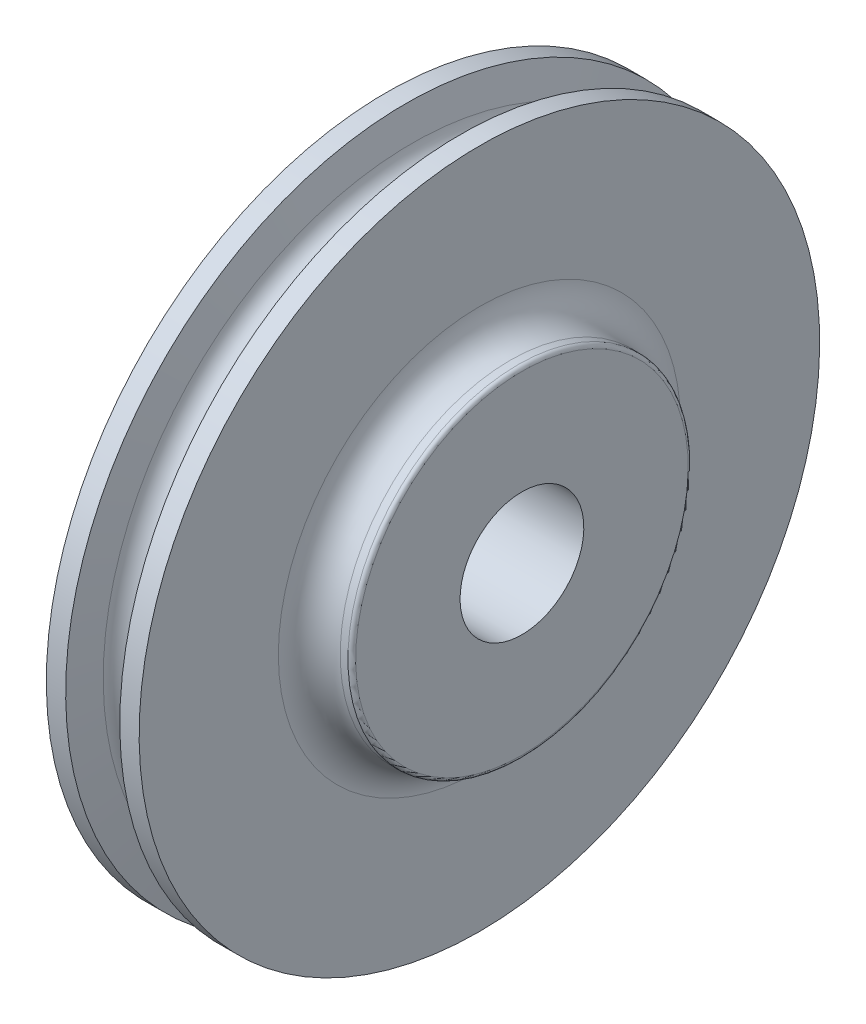
ISO-10303-21;
HEADER;
FILE_DESCRIPTION(('STEP AP214'),'2;1');
FILE_NAME('part.step','',(''),(''),'','','');
FILE_SCHEMA(('AUTOMOTIVE_DESIGN { 1 0 10303 214 1 1 1 1 }'));
ENDSEC;
DATA;
#1=APPLICATION_CONTEXT('core data for automotive mechanical design processes');
#2=APPLICATION_PROTOCOL_DEFINITION('international standard','automotive_design',2000,#1);
#3=PRODUCT_CONTEXT('',#1,'mechanical');
#4=PRODUCT('Part','Part','',(#3));
#5=PRODUCT_RELATED_PRODUCT_CATEGORY('part','',(#4));
#6=PRODUCT_DEFINITION_FORMATION('','',#4);
#7=PRODUCT_DEFINITION_CONTEXT('part definition',#1,'design');
#8=PRODUCT_DEFINITION('design','',#6,#7);
#9=PRODUCT_DEFINITION_SHAPE('','',#8);
#10=(LENGTH_UNIT() NAMED_UNIT(*) SI_UNIT(.MILLI.,.METRE.));
#11=(NAMED_UNIT(*) PLANE_ANGLE_UNIT() SI_UNIT($,.RADIAN.));
#12=(NAMED_UNIT(*) SI_UNIT($,.STERADIAN.) SOLID_ANGLE_UNIT());
#13=UNCERTAINTY_MEASURE_WITH_UNIT(LENGTH_MEASURE(1.E-05),#10,'distance_accuracy_value','');
#14=(GEOMETRIC_REPRESENTATION_CONTEXT(3) GLOBAL_UNCERTAINTY_ASSIGNED_CONTEXT((#13)) GLOBAL_UNIT_ASSIGNED_CONTEXT((#10,
#11,#12)) REPRESENTATION_CONTEXT('',''));
#15=CARTESIAN_POINT('',(0.,0.,0.));
#16=DIRECTION('',(0.,0.,1.));
#17=DIRECTION('',(1.,0.,0.));
#18=AXIS2_PLACEMENT_3D('',#15,#16,#17);
#19=CARTESIAN_POINT('',(-36.5125,-1.80477854883066E-13,0.));
#20=DIRECTION('',(-1.,0.,0.));
#21=DIRECTION('',(0.,-1.,0.));
#22=AXIS2_PLACEMENT_3D('',#19,#20,#21);
#23=CYLINDRICAL_SURFACE('',#22,139.700000000001);
#24=CARTESIAN_POINT('',(11.1124999999993,-4.15883752556626E-13,0.));
#25=DIRECTION('',(-1.,0.,0.));
#26=DIRECTION('',(0.,-1.,0.));
#27=AXIS2_PLACEMENT_3D('',#24,#25,#26);
#28=CIRCLE('',#27,139.700000000001);
#29=CARTESIAN_POINT('',(11.1124999999986,-139.700000000001,0.));
#30=VERTEX_POINT('',#29);
#31=EDGE_CURVE('E10',#30,#30,#28,.T.);
#32=ORIENTED_EDGE('',*,*,#31,.F.);
#33=EDGE_LOOP('',(#32));
#34=FACE_BOUND('',#33,.T.);
#35=CARTESIAN_POINT('',(19.0499999999993,-4.55118068835553E-13,0.));
#36=DIRECTION('',(-1.,0.,0.));
#37=DIRECTION('',(0.,-1.,0.));
#38=AXIS2_PLACEMENT_3D('',#35,#36,#37);
#39=CIRCLE('',#38,139.7);
#40=CARTESIAN_POINT('',(19.0499999999986,-139.700000000001,0.));
#41=VERTEX_POINT('',#40);
#42=EDGE_CURVE('E417',#41,#41,#39,.T.);
#43=ORIENTED_EDGE('',*,*,#42,.T.);
#44=EDGE_LOOP('',(#43));
#45=FACE_BOUND('',#44,.T.);
#46=ADVANCED_FACE('F371',(#34,#45),#23,.T.);
#47=CARTESIAN_POINT('',(11.1124999999993,-4.15883752556626E-13,0.));
#48=DIRECTION('',(1.,0.,0.));
#49=DIRECTION('',(0.,1.,0.));
#50=AXIS2_PLACEMENT_3D('',#47,#48,#49);
#51=CONICAL_SURFACE('',#50,139.700000000001,1.37329185721074);
#52=CARTESIAN_POINT('',(8.54282882859065,-4.03182109536545E-13,0.));
#53=DIRECTION('',(-1.,0.,0.));
#54=DIRECTION('',(0.,-1.,0.));
#55=AXIS2_PLACEMENT_3D('',#52,#53,#54);
#56=CIRCLE('',#55,126.858916600095);
#57=CARTESIAN_POINT('',(8.54282882859002,-126.858916600095,0.));
#58=VERTEX_POINT('',#57);
#59=EDGE_CURVE('E377',#58,#58,#56,.T.);
#60=ORIENTED_EDGE('',*,*,#59,.F.);
#61=EDGE_LOOP('',(#60));
#62=FACE_BOUND('',#61,.T.);
#63=ORIENTED_EDGE('',*,*,#31,.T.);
#64=EDGE_LOOP('',(#63));
#65=FACE_BOUND('',#64,.T.);
#66=ADVANCED_FACE('F450',(#62,#65),#51,.T.);
#67=CARTESIAN_POINT('',(-6.38378239159465E-13,-3.60822483003176E-13,0.));
#68=DIRECTION('',(-1.,0.,0.));
#69=DIRECTION('',(0.,-1.,0.));
#70=AXIS2_PLACEMENT_3D('',#67,#68,#69);
#71=TOROIDAL_SURFACE('',#70,128.56845,8.71219999999997);
#72=CARTESIAN_POINT('',(-8.54282882859171,-3.18729309995711E-13,0.));
#73=DIRECTION('',(-1.,0.,0.));
#74=DIRECTION('',(0.,-1.,0.));
#75=AXIS2_PLACEMENT_3D('',#72,#73,#74);
#76=CIRCLE('',#75,126.858916600095);
#77=CARTESIAN_POINT('',(-8.54282882859234,-126.858916600095,0.));
#78=VERTEX_POINT('',#77);
#79=EDGE_CURVE('E381',#78,#78,#76,.T.);
#80=ORIENTED_EDGE('',*,*,#79,.F.);
#81=EDGE_LOOP('',(#80));
#82=FACE_BOUND('',#81,.T.);
#83=ORIENTED_EDGE('',*,*,#59,.T.);
#84=EDGE_LOOP('',(#83));
#85=FACE_BOUND('',#84,.T.);
#86=ADVANCED_FACE('F455',(#82,#85),#71,.F.);
#87=CARTESIAN_POINT('',(-8.54282882859171,-3.18729309995711E-13,0.));
#88=DIRECTION('',(-1.,0.,0.));
#89=DIRECTION('',(0.,-1.,0.));
#90=AXIS2_PLACEMENT_3D('',#87,#88,#89);
#91=CONICAL_SURFACE('',#90,126.858916600095,1.37329185721071);
#92=CARTESIAN_POINT('',(-11.1125000000007,-3.06027666975629E-13,0.));
#93=DIRECTION('',(-1.,0.,0.));
#94=DIRECTION('',(0.,-1.,0.));
#95=AXIS2_PLACEMENT_3D('',#92,#93,#94);
#96=CIRCLE('',#95,139.7);
#97=CARTESIAN_POINT('',(-11.1125000000014,-139.700000000001,0.));
#98=VERTEX_POINT('',#97);
#99=EDGE_CURVE('E385',#98,#98,#96,.T.);
#100=ORIENTED_EDGE('',*,*,#99,.F.);
#101=EDGE_LOOP('',(#100));
#102=FACE_BOUND('',#101,.T.);
#103=ORIENTED_EDGE('',*,*,#79,.T.);
#104=EDGE_LOOP('',(#103));
#105=FACE_BOUND('',#104,.T.);
#106=ADVANCED_FACE('F511',(#102,#105),#91,.T.);
#107=CARTESIAN_POINT('',(-36.5125,-1.80477854883066E-13,0.));
#108=DIRECTION('',(-1.,0.,0.));
#109=DIRECTION('',(0.,-1.,0.));
#110=AXIS2_PLACEMENT_3D('',#107,#108,#109);
#111=CYLINDRICAL_SURFACE('',#110,139.7);
#112=CARTESIAN_POINT('',(-19.0500000000007,-2.66793350696702E-13,0.));
#113=DIRECTION('',(-1.,0.,0.));
#114=DIRECTION('',(0.,-1.,0.));
#115=AXIS2_PLACEMENT_3D('',#112,#113,#114);
#116=CIRCLE('',#115,139.7);
#117=CARTESIAN_POINT('',(-19.0500000000014,-139.7,0.));
#118=VERTEX_POINT('',#117);
#119=EDGE_CURVE('E390',#118,#118,#116,.T.);
#120=ORIENTED_EDGE('',*,*,#119,.F.);
#121=EDGE_LOOP('',(#120));
#122=FACE_BOUND('',#121,.T.);
#123=ORIENTED_EDGE('',*,*,#99,.T.);
#124=EDGE_LOOP('',(#123));
#125=FACE_BOUND('',#124,.T.);
#126=ADVANCED_FACE('F505',(#122,#125),#111,.T.);
#127=CARTESIAN_POINT('',(-19.0499999999998,139.7,0.));
#128=DIRECTION('',(1.,0.,0.));
#129=DIRECTION('',(0.,1.,0.));
#130=AXIS2_PLACEMENT_3D('',#127,#128,#129);
#131=PLANE('',#130);
#132=CARTESIAN_POINT('',(-19.0500000000003,-2.66793350696704E-13,0.));
#133=DIRECTION('',(-1.,0.,0.));
#134=DIRECTION('',(0.,-1.,0.));
#135=AXIS2_PLACEMENT_3D('',#132,#133,#134);
#136=CIRCLE('',#135,82.5499999999998);
#137=CARTESIAN_POINT('',(-19.0500000000007,-82.5500000000001,0.));
#138=VERTEX_POINT('',#137);
#139=EDGE_CURVE('E393',#138,#138,#136,.T.);
#140=ORIENTED_EDGE('',*,*,#139,.F.);
#141=EDGE_LOOP('',(#140));
#142=FACE_BOUND('',#141,.T.);
#143=ORIENTED_EDGE('',*,*,#119,.T.);
#144=EDGE_LOOP('',(#143));
#145=FACE_BOUND('',#144,.T.);
#146=ADVANCED_FACE('F499',(#142,#145),#131,.F.);
#147=CARTESIAN_POINT('',(-31.7500000000004,-2.08166817117217E-13,0.));
#148=DIRECTION('',(-1.,0.,0.));
#149=DIRECTION('',(0.,-1.,0.));
#150=AXIS2_PLACEMENT_3D('',#147,#148,#149);
#151=TOROIDAL_SURFACE('',#150,82.5499999999997,12.7000000000001);
#152=CARTESIAN_POINT('',(-31.7500000000004,-2.0401844465042E-13,0.));
#153=DIRECTION('',(-1.,0.,0.));
#154=DIRECTION('',(0.,-1.,0.));
#155=AXIS2_PLACEMENT_3D('',#152,#153,#154);
#156=CIRCLE('',#155,69.8499999999996);
#157=CARTESIAN_POINT('',(-31.7500000000007,-69.8499999999998,0.));
#158=VERTEX_POINT('',#157);
#159=EDGE_CURVE('E396',#158,#158,#156,.T.);
#160=ORIENTED_EDGE('',*,*,#159,.F.);
#161=EDGE_LOOP('',(#160));
#162=FACE_BOUND('',#161,.T.);
#163=ORIENTED_EDGE('',*,*,#139,.T.);
#164=EDGE_LOOP('',(#163));
#165=FACE_BOUND('',#164,.T.);
#166=ADVANCED_FACE('F493',(#162,#165),#151,.F.);
#167=CARTESIAN_POINT('',(-36.5125,-1.80477854883066E-13,0.));
#168=DIRECTION('',(-1.,0.,0.));
#169=DIRECTION('',(0.,-1.,0.));
#170=AXIS2_PLACEMENT_3D('',#167,#168,#169);
#171=CYLINDRICAL_SURFACE('',#170,69.8499999999997);
#172=CARTESIAN_POINT('',(-34.9250000000004,-1.88324718138849E-13,0.));
#173=DIRECTION('',(-1.,0.,0.));
#174=DIRECTION('',(0.,-1.,0.));
#175=AXIS2_PLACEMENT_3D('',#172,#173,#174);
#176=CIRCLE('',#175,69.8499999999997);
#177=CARTESIAN_POINT('',(-34.9250000000007,-69.8499999999999,0.));
#178=VERTEX_POINT('',#177);
#179=EDGE_CURVE('E399',#178,#178,#176,.T.);
#180=ORIENTED_EDGE('',*,*,#179,.F.);
#181=EDGE_LOOP('',(#180));
#182=FACE_BOUND('',#181,.T.);
#183=ORIENTED_EDGE('',*,*,#159,.T.);
#184=EDGE_LOOP('',(#183));
#185=FACE_BOUND('',#184,.T.);
#186=ADVANCED_FACE('F487',(#182,#185),#171,.T.);
#187=CARTESIAN_POINT('',(-34.9250000000004,-1.94289029309402E-13,0.));
#188=DIRECTION('',(-1.,0.,0.));
#189=DIRECTION('',(0.,-1.,0.));
#190=AXIS2_PLACEMENT_3D('',#187,#188,#189);
#191=TOROIDAL_SURFACE('',#190,68.2624999999997,1.58749999999998);
#192=CARTESIAN_POINT('',(-36.5125000000003,-1.80477854883064E-13,0.));
#193=DIRECTION('',(-1.,0.,0.));
#194=DIRECTION('',(0.,-1.,0.));
#195=AXIS2_PLACEMENT_3D('',#192,#193,#194);
#196=CIRCLE('',#195,68.2624999999997);
#197=CARTESIAN_POINT('',(-36.5125000000007,-68.2624999999998,0.));
#198=VERTEX_POINT('',#197);
#199=EDGE_CURVE('E402',#198,#198,#196,.T.);
#200=ORIENTED_EDGE('',*,*,#199,.F.);
#201=EDGE_LOOP('',(#200));
#202=FACE_BOUND('',#201,.T.);
#203=ORIENTED_EDGE('',*,*,#179,.T.);
#204=EDGE_LOOP('',(#203));
#205=FACE_BOUND('',#204,.T.);
#206=ADVANCED_FACE('F482',(#202,#205),#191,.T.);
#207=CARTESIAN_POINT('',(-36.5124999999998,68.2624999999995,0.));
#208=DIRECTION('',(1.,0.,0.));
#209=DIRECTION('',(0.,1.,0.));
#210=AXIS2_PLACEMENT_3D('',#207,#208,#209);
#211=PLANE('',#210);
#212=CARTESIAN_POINT('',(-36.5125000000007,1.80477854883069E-13,0.));
#213=DIRECTION('',(1.,0.,0.));
#214=DIRECTION('',(0.,1.,0.));
#215=AXIS2_PLACEMENT_3D('',#212,#213,#214);
#216=CIRCLE('',#215,25.40635);
#217=CARTESIAN_POINT('',(-36.5125000000006,25.4063500000002,0.));
#218=VERTEX_POINT('',#217);
#219=EDGE_CURVE('E420',#218,#218,#216,.T.);
#220=ORIENTED_EDGE('',*,*,#219,.T.);
#221=EDGE_LOOP('',(#220));
#222=FACE_BOUND('',#221,.T.);
#223=ORIENTED_EDGE('',*,*,#199,.T.);
#224=EDGE_LOOP('',(#223));
#225=FACE_BOUND('',#224,.T.);
#226=ADVANCED_FACE('F433',(#222,#225),#211,.F.);
#227=CARTESIAN_POINT('',(36.5125000000002,68.2624999999995,0.));
#228=DIRECTION('',(-1.,0.,0.));
#229=DIRECTION('',(0.,-1.,0.));
#230=AXIS2_PLACEMENT_3D('',#227,#228,#229);
#231=PLANE('',#230);
#232=CARTESIAN_POINT('',(36.5124999999998,-1.80477854883065E-13,0.));
#233=DIRECTION('',(1.,0.,0.));
#234=DIRECTION('',(0.,1.,0.));
#235=AXIS2_PLACEMENT_3D('',#232,#233,#234);
#236=CIRCLE('',#235,25.40635);
#237=CARTESIAN_POINT('',(36.5125,25.4063499999998,0.));
#238=VERTEX_POINT('',#237);
#239=EDGE_CURVE('E423',#238,#238,#236,.T.);
#240=ORIENTED_EDGE('',*,*,#239,.F.);
#241=EDGE_LOOP('',(#240));
#242=FACE_BOUND('',#241,.T.);
#243=CARTESIAN_POINT('',(36.5124999999997,-5.41433564649195E-13,0.));
#244=DIRECTION('',(-1.,0.,0.));
#245=DIRECTION('',(0.,-1.,0.));
#246=AXIS2_PLACEMENT_3D('',#243,#244,#245);
#247=CIRCLE('',#246,68.2625);
#248=CARTESIAN_POINT('',(36.5124999999993,-68.2625000000006,0.));
#249=VERTEX_POINT('',#248);
#250=EDGE_CURVE('E405',#249,#249,#247,.T.);
#251=ORIENTED_EDGE('',*,*,#250,.F.);
#252=EDGE_LOOP('',(#251));
#253=FACE_BOUND('',#252,.T.);
#254=ADVANCED_FACE('F429',(#242,#253),#231,.F.);
#255=CARTESIAN_POINT('',(34.9249999999997,-5.27355936696949E-13,0.));
#256=DIRECTION('',(-1.,0.,0.));
#257=DIRECTION('',(0.,-1.,0.));
#258=AXIS2_PLACEMENT_3D('',#255,#256,#257);
#259=TOROIDAL_SURFACE('',#258,68.2625,1.58749999999998);
#260=CARTESIAN_POINT('',(34.9249999999997,-5.33586701393409E-13,0.));
#261=DIRECTION('',(-1.,0.,0.));
#262=DIRECTION('',(0.,-1.,0.));
#263=AXIS2_PLACEMENT_3D('',#260,#261,#262);
#264=CIRCLE('',#263,69.85);
#265=CARTESIAN_POINT('',(34.9249999999993,-69.8500000000005,0.));
#266=VERTEX_POINT('',#265);
#267=EDGE_CURVE('E408',#266,#266,#264,.T.);
#268=ORIENTED_EDGE('',*,*,#267,.F.);
#269=EDGE_LOOP('',(#268));
#270=FACE_BOUND('',#269,.T.);
#271=ORIENTED_EDGE('',*,*,#250,.T.);
#272=EDGE_LOOP('',(#271));
#273=FACE_BOUND('',#272,.T.);
#274=ADVANCED_FACE('F432',(#270,#273),#259,.T.);
#275=CARTESIAN_POINT('',(-36.5125,-1.80477854883066E-13,0.));
#276=DIRECTION('',(-1.,0.,0.));
#277=DIRECTION('',(0.,-1.,0.));
#278=AXIS2_PLACEMENT_3D('',#275,#276,#277);
#279=CYLINDRICAL_SURFACE('',#278,69.85);
#280=CARTESIAN_POINT('',(31.7499999999997,-5.17892974881838E-13,0.));
#281=DIRECTION('',(-1.,0.,0.));
#282=DIRECTION('',(0.,-1.,0.));
#283=AXIS2_PLACEMENT_3D('',#280,#281,#282);
#284=CIRCLE('',#283,69.85);
#285=CARTESIAN_POINT('',(31.7499999999993,-69.8500000000005,0.));
#286=VERTEX_POINT('',#285);
#287=EDGE_CURVE('E411',#286,#286,#284,.T.);
#288=ORIENTED_EDGE('',*,*,#287,.F.);
#289=EDGE_LOOP('',(#288));
#290=FACE_BOUND('',#289,.T.);
#291=ORIENTED_EDGE('',*,*,#267,.T.);
#292=EDGE_LOOP('',(#291));
#293=FACE_BOUND('',#292,.T.);
#294=ADVANCED_FACE('F438',(#290,#293),#279,.T.);
#295=CARTESIAN_POINT('',(31.7499999999996,-5.13478148889135E-13,0.));
#296=DIRECTION('',(-1.,0.,0.));
#297=DIRECTION('',(0.,-1.,0.));
#298=AXIS2_PLACEMENT_3D('',#295,#296,#297);
#299=TOROIDAL_SURFACE('',#298,82.55,12.7);
#300=CARTESIAN_POINT('',(19.0499999999996,-4.55118068835554E-13,0.));
#301=DIRECTION('',(-1.,0.,0.));
#302=DIRECTION('',(0.,-1.,0.));
#303=AXIS2_PLACEMENT_3D('',#300,#301,#302);
#304=CIRCLE('',#303,82.5499999999999);
#305=CARTESIAN_POINT('',(19.0499999999992,-82.5500000000004,0.));
#306=VERTEX_POINT('',#305);
#307=EDGE_CURVE('E414',#306,#306,#304,.T.);
#308=ORIENTED_EDGE('',*,*,#307,.F.);
#309=EDGE_LOOP('',(#308));
#310=FACE_BOUND('',#309,.T.);
#311=ORIENTED_EDGE('',*,*,#287,.T.);
#312=EDGE_LOOP('',(#311));
#313=FACE_BOUND('',#312,.T.);
#314=ADVANCED_FACE('F445',(#310,#313),#299,.F.);
#315=CARTESIAN_POINT('',(19.0500000000001,139.7,0.));
#316=DIRECTION('',(-1.,0.,0.));
#317=DIRECTION('',(0.,-1.,0.));
#318=AXIS2_PLACEMENT_3D('',#315,#316,#317);
#319=PLANE('',#318);
#320=ORIENTED_EDGE('',*,*,#42,.F.);
#321=EDGE_LOOP('',(#320));
#322=FACE_BOUND('',#321,.T.);
#323=ORIENTED_EDGE('',*,*,#307,.T.);
#324=EDGE_LOOP('',(#323));
#325=FACE_BOUND('',#324,.T.);
#326=ADVANCED_FACE('F460',(#322,#325),#319,.F.);
#327=CARTESIAN_POINT('',(-36.5125000000007,1.80477854883069E-13,0.));
#328=DIRECTION('',(1.,0.,0.));
#329=DIRECTION('',(0.,1.,0.));
#330=AXIS2_PLACEMENT_3D('',#327,#328,#329);
#331=CYLINDRICAL_SURFACE('',#330,25.40635);
#332=ORIENTED_EDGE('',*,*,#219,.F.);
#333=EDGE_LOOP('',(#332));
#334=FACE_BOUND('',#333,.T.);
#335=ORIENTED_EDGE('',*,*,#239,.T.);
#336=EDGE_LOOP('',(#335));
#337=FACE_BOUND('',#336,.T.);
#338=ADVANCED_FACE('F427',(#334,#337),#331,.F.);
#339=CLOSED_SHELL('',(#46,#66,#86,#106,#126,#146,#166,#186,#206,#226,#254,#274,#294,#314,#326,#338));
#340=MANIFOLD_SOLID_BREP('B2',#339);
#341=ADVANCED_BREP_SHAPE_REPRESENTATION('',(#18,#340),#14);
#342=SHAPE_DEFINITION_REPRESENTATION(#9,#341);
ENDSEC;
END-ISO-10303-21;
